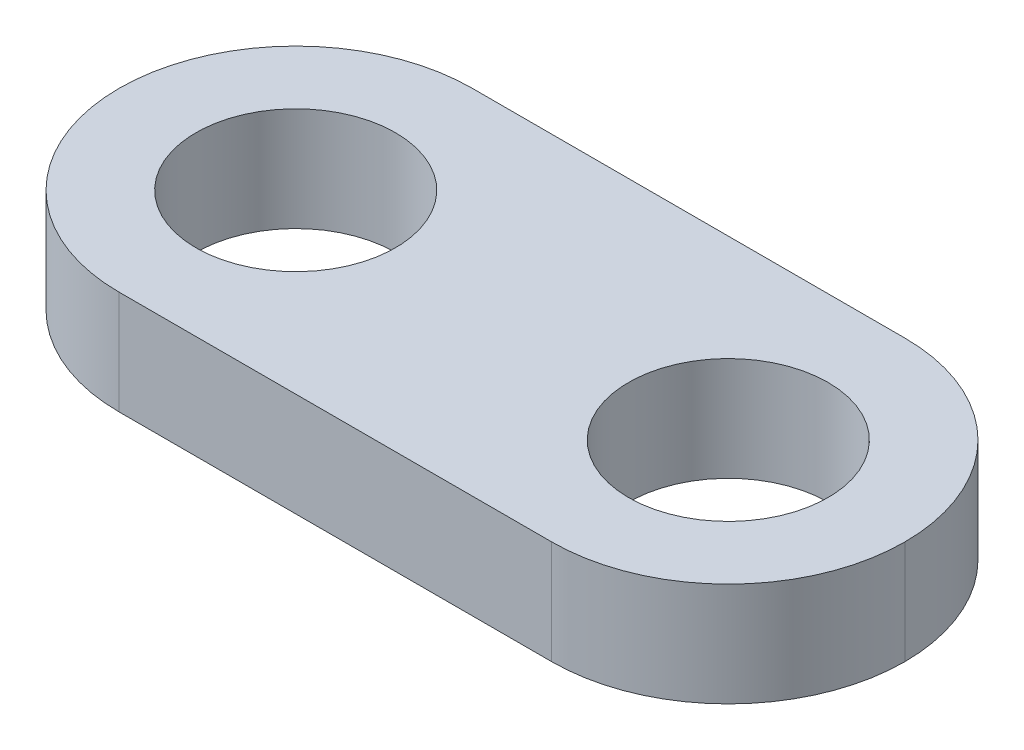
ISO-10303-21;
HEADER;
FILE_DESCRIPTION(('STEP AP214'),'2;1');
FILE_NAME('part.step','',(''),(''),'','','');
FILE_SCHEMA(('AUTOMOTIVE_DESIGN { 1 0 10303 214 1 1 1 1 }'));
ENDSEC;
DATA;
#1=APPLICATION_CONTEXT('core data for automotive mechanical design processes');
#2=APPLICATION_PROTOCOL_DEFINITION('international standard','automotive_design',2000,#1);
#3=PRODUCT_CONTEXT('',#1,'mechanical');
#4=PRODUCT('Part','Part','',(#3));
#5=PRODUCT_RELATED_PRODUCT_CATEGORY('part','',(#4));
#6=PRODUCT_DEFINITION_FORMATION('','',#4);
#7=PRODUCT_DEFINITION_CONTEXT('part definition',#1,'design');
#8=PRODUCT_DEFINITION('design','',#6,#7);
#9=PRODUCT_DEFINITION_SHAPE('','',#8);
#10=(LENGTH_UNIT() NAMED_UNIT(*) SI_UNIT(.MILLI.,.METRE.));
#11=(NAMED_UNIT(*) PLANE_ANGLE_UNIT() SI_UNIT($,.RADIAN.));
#12=(NAMED_UNIT(*) SI_UNIT($,.STERADIAN.) SOLID_ANGLE_UNIT());
#13=UNCERTAINTY_MEASURE_WITH_UNIT(LENGTH_MEASURE(1.E-05),#10,'distance_accuracy_value','');
#14=(GEOMETRIC_REPRESENTATION_CONTEXT(3) GLOBAL_UNCERTAINTY_ASSIGNED_CONTEXT((#13)) GLOBAL_UNIT_ASSIGNED_CONTEXT((#10,
#11,#12)) REPRESENTATION_CONTEXT('',''));
#15=CARTESIAN_POINT('',(0.,0.,0.));
#16=DIRECTION('',(0.,0.,1.));
#17=DIRECTION('',(1.,0.,0.));
#18=AXIS2_PLACEMENT_3D('',#15,#16,#17);
#19=CARTESIAN_POINT('',(0.,2.35,0.));
#20=DIRECTION('',(0.,0.,-1.));
#21=DIRECTION('',(-1.,0.,0.));
#22=AXIS2_PLACEMENT_3D('',#19,#20,#21);
#23=PLANE('',#22);
#24=DIRECTION('',(1.,0.,0.));
#25=VECTOR('',#24,1.);
#26=CARTESIAN_POINT('',(0.,0.,0.));
#27=LINE('',#26,#25);
#28=CARTESIAN_POINT('',(4.,0.,0.));
#29=VERTEX_POINT('',#28);
#30=CARTESIAN_POINT('',(13.8,0.,0.));
#31=VERTEX_POINT('',#30);
#32=EDGE_CURVE('E99',#29,#31,#27,.T.);
#33=ORIENTED_EDGE('',*,*,#32,.T.);
#34=DIRECTION('',(0.,-1.,0.));
#35=VECTOR('',#34,1.);
#36=CARTESIAN_POINT('',(13.8,2.35,0.));
#37=LINE('',#36,#35);
#38=CARTESIAN_POINT('',(13.8,2.35,0.));
#39=VERTEX_POINT('',#38);
#40=EDGE_CURVE('E141',#31,#39,#37,.F.);
#41=ORIENTED_EDGE('',*,*,#40,.T.);
#42=DIRECTION('',(1.,0.,0.));
#43=VECTOR('',#42,1.);
#44=CARTESIAN_POINT('',(0.,2.35,0.));
#45=LINE('',#44,#43);
#46=CARTESIAN_POINT('',(4.,2.35,0.));
#47=VERTEX_POINT('',#46);
#48=EDGE_CURVE('E156',#47,#39,#45,.T.);
#49=ORIENTED_EDGE('',*,*,#48,.F.);
#50=DIRECTION('',(0.,-1.,0.));
#51=VECTOR('',#50,1.);
#52=CARTESIAN_POINT('',(4.,2.35,0.));
#53=LINE('',#52,#51);
#54=EDGE_CURVE('E145',#47,#29,#53,.T.);
#55=ORIENTED_EDGE('',*,*,#54,.T.);
#56=EDGE_LOOP('',(#33,#41,#49,#55));
#57=FACE_BOUND('',#56,.T.);
#58=ADVANCED_FACE('F39',(#57),#23,.F.);
#59=CARTESIAN_POINT('',(0.,2.35,-8.));
#60=DIRECTION('',(0.,0.,1.));
#61=DIRECTION('',(1.,0.,0.));
#62=AXIS2_PLACEMENT_3D('',#59,#60,#61);
#63=PLANE('',#62);
#64=DIRECTION('',(-1.,0.,0.));
#65=VECTOR('',#64,1.);
#66=CARTESIAN_POINT('',(0.,2.35,-8.));
#67=LINE('',#66,#65);
#68=CARTESIAN_POINT('',(13.8,2.35,-8.));
#69=VERTEX_POINT('',#68);
#70=CARTESIAN_POINT('',(4.,2.35,-8.));
#71=VERTEX_POINT('',#70);
#72=EDGE_CURVE('E112',#69,#71,#67,.T.);
#73=ORIENTED_EDGE('',*,*,#72,.F.);
#74=DIRECTION('',(0.,-1.,0.));
#75=VECTOR('',#74,1.);
#76=CARTESIAN_POINT('',(13.8,2.35,-8.));
#77=LINE('',#76,#75);
#78=CARTESIAN_POINT('',(13.8,0.,-8.));
#79=VERTEX_POINT('',#78);
#80=EDGE_CURVE('E11',#69,#79,#77,.T.);
#81=ORIENTED_EDGE('',*,*,#80,.T.);
#82=DIRECTION('',(-1.,0.,0.));
#83=VECTOR('',#82,1.);
#84=CARTESIAN_POINT('',(0.,0.,-8.));
#85=LINE('',#84,#83);
#86=CARTESIAN_POINT('',(4.,0.,-8.));
#87=VERTEX_POINT('',#86);
#88=EDGE_CURVE('E153',#79,#87,#85,.T.);
#89=ORIENTED_EDGE('',*,*,#88,.T.);
#90=DIRECTION('',(0.,-1.,0.));
#91=VECTOR('',#90,1.);
#92=CARTESIAN_POINT('',(4.,2.35,-8.));
#93=LINE('',#92,#91);
#94=EDGE_CURVE('E49',#87,#71,#93,.F.);
#95=ORIENTED_EDGE('',*,*,#94,.T.);
#96=EDGE_LOOP('',(#73,#81,#89,#95));
#97=FACE_BOUND('',#96,.T.);
#98=ADVANCED_FACE('F189',(#97),#63,.F.);
#99=CARTESIAN_POINT('',(0.,2.35,0.));
#100=DIRECTION('',(0.,-1.,0.));
#101=DIRECTION('',(0.,0.,-1.));
#102=AXIS2_PLACEMENT_3D('',#99,#100,#101);
#103=PLANE('',#102);
#104=CARTESIAN_POINT('',(4.,2.35,-4.));
#105=DIRECTION('',(0.,1.,0.));
#106=DIRECTION('',(0.,0.,1.));
#107=AXIS2_PLACEMENT_3D('',#104,#105,#106);
#108=CIRCLE('',#107,2.26);
#109=CARTESIAN_POINT('',(4.,2.35,-1.74));
#110=VERTEX_POINT('',#109);
#111=EDGE_CURVE('E168',#110,#110,#108,.T.);
#112=ORIENTED_EDGE('',*,*,#111,.F.);
#113=EDGE_LOOP('',(#112));
#114=FACE_BOUND('',#113,.T.);
#115=CARTESIAN_POINT('',(13.8,2.35,-4.));
#116=DIRECTION('',(0.,1.,0.));
#117=DIRECTION('',(0.,0.,1.));
#118=AXIS2_PLACEMENT_3D('',#115,#116,#117);
#119=CIRCLE('',#118,2.26);
#120=CARTESIAN_POINT('',(13.8,2.35,-1.74));
#121=VERTEX_POINT('',#120);
#122=EDGE_CURVE('E120',#121,#121,#119,.T.);
#123=ORIENTED_EDGE('',*,*,#122,.F.);
#124=EDGE_LOOP('',(#123));
#125=FACE_BOUND('',#124,.T.);
#126=ORIENTED_EDGE('',*,*,#48,.T.);
#127=CARTESIAN_POINT('',(13.8,2.35,-4.));
#128=DIRECTION('',(0.,-1.,0.));
#129=DIRECTION('',(0.,0.,-1.));
#130=AXIS2_PLACEMENT_3D('',#127,#128,#129);
#131=CIRCLE('',#130,4.);
#132=CARTESIAN_POINT('',(17.8,2.35,-4.));
#133=VERTEX_POINT('',#132);
#134=EDGE_CURVE('E131',#39,#133,#131,.F.);
#135=ORIENTED_EDGE('',*,*,#134,.T.);
#136=CARTESIAN_POINT('',(13.8,2.35,-4.));
#137=DIRECTION('',(0.,-1.,0.));
#138=DIRECTION('',(0.,0.,-1.));
#139=AXIS2_PLACEMENT_3D('',#136,#137,#138);
#140=CIRCLE('',#139,4.);
#141=EDGE_CURVE('E63',#133,#69,#140,.F.);
#142=ORIENTED_EDGE('',*,*,#141,.T.);
#143=ORIENTED_EDGE('',*,*,#72,.T.);
#144=CARTESIAN_POINT('',(4.,2.35,-4.));
#145=DIRECTION('',(0.,-1.,0.));
#146=DIRECTION('',(0.,0.,-1.));
#147=AXIS2_PLACEMENT_3D('',#144,#145,#146);
#148=CIRCLE('',#147,4.);
#149=CARTESIAN_POINT('',(0.,2.35,-4.));
#150=VERTEX_POINT('',#149);
#151=EDGE_CURVE('E138',#71,#150,#148,.F.);
#152=ORIENTED_EDGE('',*,*,#151,.T.);
#153=CARTESIAN_POINT('',(4.,2.35,-4.));
#154=DIRECTION('',(0.,-1.,0.));
#155=DIRECTION('',(0.,0.,-1.));
#156=AXIS2_PLACEMENT_3D('',#153,#154,#155);
#157=CIRCLE('',#156,4.);
#158=EDGE_CURVE('E115',#150,#47,#157,.F.);
#159=ORIENTED_EDGE('',*,*,#158,.T.);
#160=EDGE_LOOP('',(#126,#135,#142,#143,#152,#159));
#161=FACE_BOUND('',#160,.T.);
#162=ADVANCED_FACE('F186',(#114,#125,#161),#103,.F.);
#163=CARTESIAN_POINT('',(0.,0.,0.));
#164=DIRECTION('',(0.,-1.,0.));
#165=DIRECTION('',(0.,0.,-1.));
#166=AXIS2_PLACEMENT_3D('',#163,#164,#165);
#167=PLANE('',#166);
#168=CARTESIAN_POINT('',(4.,0.,-4.));
#169=DIRECTION('',(0.,1.,0.));
#170=DIRECTION('',(0.,0.,1.));
#171=AXIS2_PLACEMENT_3D('',#168,#169,#170);
#172=CIRCLE('',#171,2.26);
#173=CARTESIAN_POINT('',(4.,0.,-1.74));
#174=VERTEX_POINT('',#173);
#175=EDGE_CURVE('E159',#174,#174,#172,.T.);
#176=ORIENTED_EDGE('',*,*,#175,.T.);
#177=EDGE_LOOP('',(#176));
#178=FACE_BOUND('',#177,.T.);
#179=CARTESIAN_POINT('',(13.8,0.,-4.));
#180=DIRECTION('',(0.,1.,0.));
#181=DIRECTION('',(0.,0.,1.));
#182=AXIS2_PLACEMENT_3D('',#179,#180,#181);
#183=CIRCLE('',#182,2.26);
#184=CARTESIAN_POINT('',(13.8,0.,-1.74));
#185=VERTEX_POINT('',#184);
#186=EDGE_CURVE('E126',#185,#185,#183,.T.);
#187=ORIENTED_EDGE('',*,*,#186,.T.);
#188=EDGE_LOOP('',(#187));
#189=FACE_BOUND('',#188,.T.);
#190=CARTESIAN_POINT('',(13.8,0.,-4.));
#191=DIRECTION('',(0.,-1.,0.));
#192=DIRECTION('',(0.,0.,-1.));
#193=AXIS2_PLACEMENT_3D('',#190,#191,#192);
#194=CIRCLE('',#193,4.);
#195=CARTESIAN_POINT('',(17.8,0.,-4.));
#196=VERTEX_POINT('',#195);
#197=EDGE_CURVE('E105',#79,#196,#194,.T.);
#198=ORIENTED_EDGE('',*,*,#197,.T.);
#199=CARTESIAN_POINT('',(13.8,0.,-4.));
#200=DIRECTION('',(0.,-1.,0.));
#201=DIRECTION('',(0.,0.,-1.));
#202=AXIS2_PLACEMENT_3D('',#199,#200,#201);
#203=CIRCLE('',#202,4.);
#204=EDGE_CURVE('E148',#196,#31,#203,.T.);
#205=ORIENTED_EDGE('',*,*,#204,.T.);
#206=ORIENTED_EDGE('',*,*,#32,.F.);
#207=CARTESIAN_POINT('',(4.,0.,-4.));
#208=DIRECTION('',(0.,-1.,0.));
#209=DIRECTION('',(0.,0.,-1.));
#210=AXIS2_PLACEMENT_3D('',#207,#208,#209);
#211=CIRCLE('',#210,4.);
#212=CARTESIAN_POINT('',(0.,0.,-4.));
#213=VERTEX_POINT('',#212);
#214=EDGE_CURVE('E93',#29,#213,#211,.T.);
#215=ORIENTED_EDGE('',*,*,#214,.T.);
#216=CARTESIAN_POINT('',(4.,0.,-4.));
#217=DIRECTION('',(0.,-1.,0.));
#218=DIRECTION('',(0.,0.,-1.));
#219=AXIS2_PLACEMENT_3D('',#216,#217,#218);
#220=CIRCLE('',#219,4.);
#221=EDGE_CURVE('E97',#213,#87,#220,.T.);
#222=ORIENTED_EDGE('',*,*,#221,.T.);
#223=ORIENTED_EDGE('',*,*,#88,.F.);
#224=EDGE_LOOP('',(#198,#205,#206,#215,#222,#223));
#225=FACE_BOUND('',#224,.T.);
#226=ADVANCED_FACE('F95',(#178,#189,#225),#167,.T.);
#227=CARTESIAN_POINT('',(13.8,0.,-4.));
#228=DIRECTION('',(0.,1.,0.));
#229=DIRECTION('',(0.,0.,1.));
#230=AXIS2_PLACEMENT_3D('',#227,#228,#229);
#231=CYLINDRICAL_SURFACE('',#230,2.26);
#232=ORIENTED_EDGE('',*,*,#186,.F.);
#233=EDGE_LOOP('',(#232));
#234=FACE_BOUND('',#233,.T.);
#235=ORIENTED_EDGE('',*,*,#122,.T.);
#236=EDGE_LOOP('',(#235));
#237=FACE_BOUND('',#236,.T.);
#238=ADVANCED_FACE('F182',(#234,#237),#231,.F.);
#239=CARTESIAN_POINT('',(4.,0.,-4.));
#240=DIRECTION('',(0.,1.,0.));
#241=DIRECTION('',(0.,0.,1.));
#242=AXIS2_PLACEMENT_3D('',#239,#240,#241);
#243=CYLINDRICAL_SURFACE('',#242,2.26);
#244=ORIENTED_EDGE('',*,*,#175,.F.);
#245=EDGE_LOOP('',(#244));
#246=FACE_BOUND('',#245,.T.);
#247=ORIENTED_EDGE('',*,*,#111,.T.);
#248=EDGE_LOOP('',(#247));
#249=FACE_BOUND('',#248,.T.);
#250=ADVANCED_FACE('F178',(#246,#249),#243,.F.);
#251=CARTESIAN_POINT('',(13.8,2.35,-4.));
#252=DIRECTION('',(0.,-1.,0.));
#253=DIRECTION('',(0.,0.,-1.));
#254=AXIS2_PLACEMENT_3D('',#251,#252,#253);
#255=CYLINDRICAL_SURFACE('',#254,4.);
#256=ORIENTED_EDGE('',*,*,#80,.F.);
#257=ORIENTED_EDGE('',*,*,#141,.F.);
#258=DIRECTION('',(0.,-1.,0.));
#259=VECTOR('',#258,1.);
#260=CARTESIAN_POINT('',(17.8,2.35,-4.));
#261=LINE('',#260,#259);
#262=EDGE_CURVE('E117',#196,#133,#261,.F.);
#263=ORIENTED_EDGE('',*,*,#262,.F.);
#264=ORIENTED_EDGE('',*,*,#197,.F.);
#265=EDGE_LOOP('',(#256,#257,#263,#264));
#266=FACE_BOUND('',#265,.T.);
#267=ADVANCED_FACE('F181',(#266),#255,.T.);
#268=CARTESIAN_POINT('',(13.8,2.35,-4.));
#269=DIRECTION('',(0.,-1.,0.));
#270=DIRECTION('',(0.,0.,-1.));
#271=AXIS2_PLACEMENT_3D('',#268,#269,#270);
#272=CYLINDRICAL_SURFACE('',#271,4.);
#273=ORIENTED_EDGE('',*,*,#134,.F.);
#274=ORIENTED_EDGE('',*,*,#40,.F.);
#275=ORIENTED_EDGE('',*,*,#204,.F.);
#276=ORIENTED_EDGE('',*,*,#262,.T.);
#277=EDGE_LOOP('',(#273,#274,#275,#276));
#278=FACE_BOUND('',#277,.T.);
#279=ADVANCED_FACE('F195',(#278),#272,.T.);
#280=CARTESIAN_POINT('',(4.,2.35,-4.));
#281=DIRECTION('',(0.,-1.,0.));
#282=DIRECTION('',(0.,0.,-1.));
#283=AXIS2_PLACEMENT_3D('',#280,#281,#282);
#284=CYLINDRICAL_SURFACE('',#283,4.);
#285=DIRECTION('',(0.,-1.,0.));
#286=VECTOR('',#285,1.);
#287=CARTESIAN_POINT('',(0.,2.35,-4.));
#288=LINE('',#287,#286);
#289=EDGE_CURVE('E43',#150,#213,#288,.T.);
#290=ORIENTED_EDGE('',*,*,#289,.F.);
#291=ORIENTED_EDGE('',*,*,#151,.F.);
#292=ORIENTED_EDGE('',*,*,#94,.F.);
#293=ORIENTED_EDGE('',*,*,#221,.F.);
#294=EDGE_LOOP('',(#290,#291,#292,#293));
#295=FACE_BOUND('',#294,.T.);
#296=ADVANCED_FACE('F41',(#295),#284,.T.);
#297=CARTESIAN_POINT('',(4.,2.35,-4.));
#298=DIRECTION('',(0.,-1.,0.));
#299=DIRECTION('',(0.,0.,-1.));
#300=AXIS2_PLACEMENT_3D('',#297,#298,#299);
#301=CYLINDRICAL_SURFACE('',#300,4.);
#302=ORIENTED_EDGE('',*,*,#158,.F.);
#303=ORIENTED_EDGE('',*,*,#289,.T.);
#304=ORIENTED_EDGE('',*,*,#214,.F.);
#305=ORIENTED_EDGE('',*,*,#54,.F.);
#306=EDGE_LOOP('',(#302,#303,#304,#305));
#307=FACE_BOUND('',#306,.T.);
#308=ADVANCED_FACE('F114',(#307),#301,.T.);
#309=CLOSED_SHELL('',(#58,#98,#162,#226,#238,#250,#267,#279,#296,#308));
#310=MANIFOLD_SOLID_BREP('B2',#309);
#311=ADVANCED_BREP_SHAPE_REPRESENTATION('',(#18,#310),#14);
#312=SHAPE_DEFINITION_REPRESENTATION(#9,#311);
ENDSEC;
END-ISO-10303-21;
